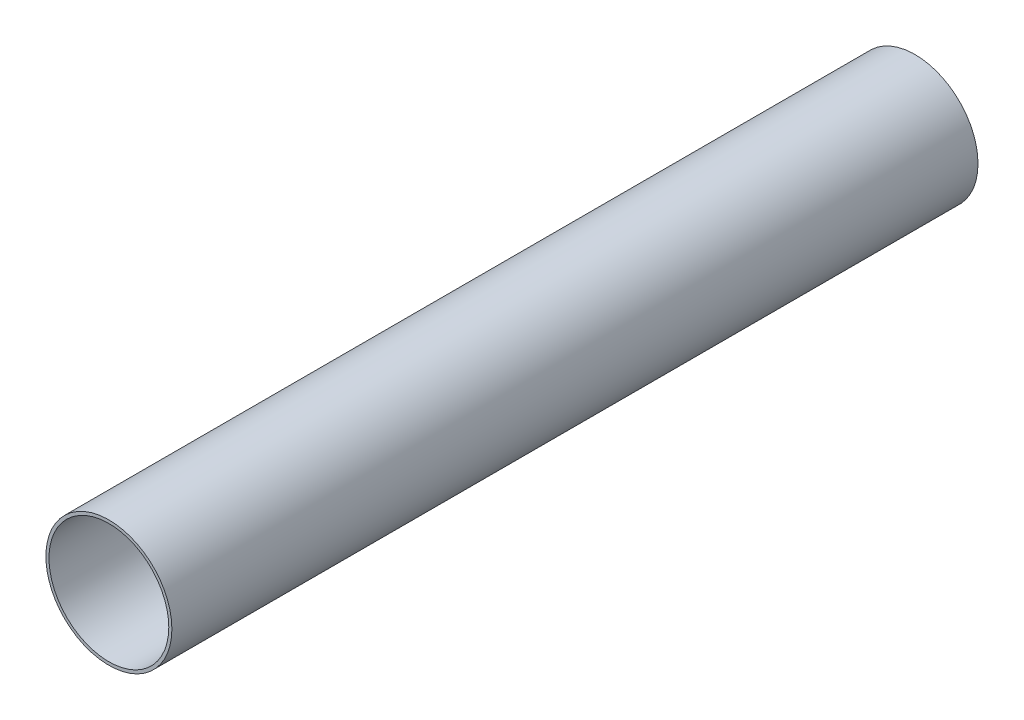
ISO-10303-21;
HEADER;
FILE_DESCRIPTION(('STEP AP214'),'2;1');
FILE_NAME('part.step','',(''),(''),'','','');
FILE_SCHEMA(('AUTOMOTIVE_DESIGN { 1 0 10303 214 1 1 1 1 }'));
ENDSEC;
DATA;
#1=APPLICATION_CONTEXT('core data for automotive mechanical design processes');
#2=APPLICATION_PROTOCOL_DEFINITION('international standard','automotive_design',2000,#1);
#3=PRODUCT_CONTEXT('',#1,'mechanical');
#4=PRODUCT('Part','Part','',(#3));
#5=PRODUCT_RELATED_PRODUCT_CATEGORY('part','',(#4));
#6=PRODUCT_DEFINITION_FORMATION('','',#4);
#7=PRODUCT_DEFINITION_CONTEXT('part definition',#1,'design');
#8=PRODUCT_DEFINITION('design','',#6,#7);
#9=PRODUCT_DEFINITION_SHAPE('','',#8);
#10=(LENGTH_UNIT() NAMED_UNIT(*) SI_UNIT(.MILLI.,.METRE.));
#11=(NAMED_UNIT(*) PLANE_ANGLE_UNIT() SI_UNIT($,.RADIAN.));
#12=(NAMED_UNIT(*) SI_UNIT($,.STERADIAN.) SOLID_ANGLE_UNIT());
#13=UNCERTAINTY_MEASURE_WITH_UNIT(LENGTH_MEASURE(1.E-05),#10,'distance_accuracy_value','');
#14=(GEOMETRIC_REPRESENTATION_CONTEXT(3) GLOBAL_UNCERTAINTY_ASSIGNED_CONTEXT((#13)) GLOBAL_UNIT_ASSIGNED_CONTEXT((#10,
#11,#12)) REPRESENTATION_CONTEXT('',''));
#15=CARTESIAN_POINT('',(0.,0.,0.));
#16=DIRECTION('',(0.,0.,1.));
#17=DIRECTION('',(1.,0.,0.));
#18=AXIS2_PLACEMENT_3D('',#15,#16,#17);
#19=CARTESIAN_POINT('',(0.,0.,650.));
#20=DIRECTION('',(0.,0.,1.));
#21=DIRECTION('',(1.,0.,0.));
#22=AXIS2_PLACEMENT_3D('',#19,#20,#21);
#23=PLANE('',#22);
#24=CARTESIAN_POINT('',(0.,0.,650.));
#25=DIRECTION('',(0.,0.,1.));
#26=DIRECTION('',(1.,0.,0.));
#27=AXIS2_PLACEMENT_3D('',#24,#25,#26);
#28=CIRCLE('',#27,50.8);
#29=CARTESIAN_POINT('',(50.8,0.,650.));
#30=VERTEX_POINT('',#29);
#31=EDGE_CURVE('E10',#30,#30,#28,.T.);
#32=ORIENTED_EDGE('',*,*,#31,.T.);
#33=EDGE_LOOP('',(#32));
#34=FACE_BOUND('',#33,.T.);
#35=CARTESIAN_POINT('',(0.,0.,650.));
#36=DIRECTION('',(0.,0.,1.));
#37=DIRECTION('',(1.,0.,0.));
#38=AXIS2_PLACEMENT_3D('',#35,#36,#37);
#39=CIRCLE('',#38,48.3);
#40=CARTESIAN_POINT('',(48.3,0.,650.));
#41=VERTEX_POINT('',#40);
#42=EDGE_CURVE('E48',#41,#41,#39,.T.);
#43=ORIENTED_EDGE('',*,*,#42,.F.);
#44=EDGE_LOOP('',(#43));
#45=FACE_BOUND('',#44,.T.);
#46=ADVANCED_FACE('F37',(#34,#45),#23,.T.);
#47=CARTESIAN_POINT('',(0.,0.,0.));
#48=DIRECTION('',(0.,0.,1.));
#49=DIRECTION('',(1.,0.,0.));
#50=AXIS2_PLACEMENT_3D('',#47,#48,#49);
#51=PLANE('',#50);
#52=CARTESIAN_POINT('',(0.,0.,0.));
#53=DIRECTION('',(0.,0.,1.));
#54=DIRECTION('',(1.,0.,0.));
#55=AXIS2_PLACEMENT_3D('',#52,#53,#54);
#56=CIRCLE('',#55,50.8);
#57=CARTESIAN_POINT('',(50.8,0.,0.));
#58=VERTEX_POINT('',#57);
#59=EDGE_CURVE('E41',#58,#58,#56,.T.);
#60=ORIENTED_EDGE('',*,*,#59,.F.);
#61=EDGE_LOOP('',(#60));
#62=FACE_BOUND('',#61,.T.);
#63=CARTESIAN_POINT('',(0.,0.,0.));
#64=DIRECTION('',(0.,0.,1.));
#65=DIRECTION('',(1.,0.,0.));
#66=AXIS2_PLACEMENT_3D('',#63,#64,#65);
#67=CIRCLE('',#66,48.3);
#68=CARTESIAN_POINT('',(48.3,0.,0.));
#69=VERTEX_POINT('',#68);
#70=EDGE_CURVE('E50',#69,#69,#67,.T.);
#71=ORIENTED_EDGE('',*,*,#70,.T.);
#72=EDGE_LOOP('',(#71));
#73=FACE_BOUND('',#72,.T.);
#74=ADVANCED_FACE('F60',(#62,#73),#51,.F.);
#75=CARTESIAN_POINT('',(0.,0.,650.));
#76=DIRECTION('',(0.,0.,-1.));
#77=DIRECTION('',(-1.,0.,0.));
#78=AXIS2_PLACEMENT_3D('',#75,#76,#77);
#79=CYLINDRICAL_SURFACE('',#78,50.8);
#80=ORIENTED_EDGE('',*,*,#31,.F.);
#81=EDGE_LOOP('',(#80));
#82=FACE_BOUND('',#81,.T.);
#83=ORIENTED_EDGE('',*,*,#59,.T.);
#84=EDGE_LOOP('',(#83));
#85=FACE_BOUND('',#84,.T.);
#86=ADVANCED_FACE('F39',(#82,#85),#79,.T.);
#87=CARTESIAN_POINT('',(0.,0.,650.));
#88=DIRECTION('',(0.,0.,-1.));
#89=DIRECTION('',(-1.,0.,0.));
#90=AXIS2_PLACEMENT_3D('',#87,#88,#89);
#91=CYLINDRICAL_SURFACE('',#90,48.3);
#92=ORIENTED_EDGE('',*,*,#42,.T.);
#93=EDGE_LOOP('',(#92));
#94=FACE_BOUND('',#93,.T.);
#95=ORIENTED_EDGE('',*,*,#70,.F.);
#96=EDGE_LOOP('',(#95));
#97=FACE_BOUND('',#96,.T.);
#98=ADVANCED_FACE('F56',(#94,#97),#91,.F.);
#99=CLOSED_SHELL('',(#46,#74,#86,#98));
#100=MANIFOLD_SOLID_BREP('B2',#99);
#101=ADVANCED_BREP_SHAPE_REPRESENTATION('',(#18,#100),#14);
#102=SHAPE_DEFINITION_REPRESENTATION(#9,#101);
ENDSEC;
END-ISO-10303-21;
